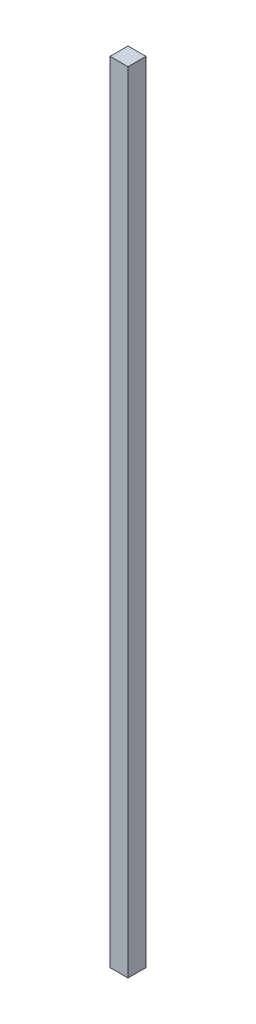
ISO-10303-21;
HEADER;
FILE_DESCRIPTION(('STEP AP214'),'2;1');
FILE_NAME('part.step','',(''),(''),'','','');
FILE_SCHEMA(('AUTOMOTIVE_DESIGN { 1 0 10303 214 1 1 1 1 }'));
ENDSEC;
DATA;
#1=APPLICATION_CONTEXT('core data for automotive mechanical design processes');
#2=APPLICATION_PROTOCOL_DEFINITION('international standard','automotive_design',2000,#1);
#3=PRODUCT_CONTEXT('',#1,'mechanical');
#4=PRODUCT('Part','Part','',(#3));
#5=PRODUCT_RELATED_PRODUCT_CATEGORY('part','',(#4));
#6=PRODUCT_DEFINITION_FORMATION('','',#4);
#7=PRODUCT_DEFINITION_CONTEXT('part definition',#1,'design');
#8=PRODUCT_DEFINITION('design','',#6,#7);
#9=PRODUCT_DEFINITION_SHAPE('','',#8);
#10=(LENGTH_UNIT() NAMED_UNIT(*) SI_UNIT(.MILLI.,.METRE.));
#11=(NAMED_UNIT(*) PLANE_ANGLE_UNIT() SI_UNIT($,.RADIAN.));
#12=(NAMED_UNIT(*) SI_UNIT($,.STERADIAN.) SOLID_ANGLE_UNIT());
#13=UNCERTAINTY_MEASURE_WITH_UNIT(LENGTH_MEASURE(1.E-05),#10,'distance_accuracy_value','');
#14=(GEOMETRIC_REPRESENTATION_CONTEXT(3) GLOBAL_UNCERTAINTY_ASSIGNED_CONTEXT((#13)) GLOBAL_UNIT_ASSIGNED_CONTEXT((#10,
#11,#12)) REPRESENTATION_CONTEXT('',''));
#15=CARTESIAN_POINT('',(0.,0.,0.));
#16=DIRECTION('',(0.,0.,1.));
#17=DIRECTION('',(1.,0.,0.));
#18=AXIS2_PLACEMENT_3D('',#15,#16,#17);
#19=CARTESIAN_POINT('',(-2.5,-110.,5.));
#20=DIRECTION('',(1.,0.,0.));
#21=DIRECTION('',(0.,0.,-1.));
#22=AXIS2_PLACEMENT_3D('',#19,#20,#21);
#23=PLANE('',#22);
#24=DIRECTION('',(0.,-1.,0.));
#25=VECTOR('',#24,1.);
#26=CARTESIAN_POINT('',(-2.5,-110.,0.));
#27=LINE('',#26,#25);
#28=CARTESIAN_POINT('',(-2.5,110.,0.));
#29=VERTEX_POINT('',#28);
#30=CARTESIAN_POINT('',(-2.5,-110.,0.));
#31=VERTEX_POINT('',#30);
#32=EDGE_CURVE('E98',#29,#31,#27,.T.);
#33=ORIENTED_EDGE('',*,*,#32,.T.);
#34=DIRECTION('',(0.,0.,-1.));
#35=VECTOR('',#34,1.);
#36=CARTESIAN_POINT('',(-2.5,-110.,5.));
#37=LINE('',#36,#35);
#38=CARTESIAN_POINT('',(-2.5,-110.,5.));
#39=VERTEX_POINT('',#38);
#40=EDGE_CURVE('E11',#39,#31,#37,.T.);
#41=ORIENTED_EDGE('',*,*,#40,.F.);
#42=DIRECTION('',(0.,-1.,0.));
#43=VECTOR('',#42,1.);
#44=CARTESIAN_POINT('',(-2.5,-110.,5.));
#45=LINE('',#44,#43);
#46=CARTESIAN_POINT('',(-2.5,110.,5.));
#47=VERTEX_POINT('',#46);
#48=EDGE_CURVE('E86',#47,#39,#45,.T.);
#49=ORIENTED_EDGE('',*,*,#48,.F.);
#50=DIRECTION('',(0.,0.,-1.));
#51=VECTOR('',#50,1.);
#52=CARTESIAN_POINT('',(-2.5,110.,5.));
#53=LINE('',#52,#51);
#54=EDGE_CURVE('E94',#47,#29,#53,.T.);
#55=ORIENTED_EDGE('',*,*,#54,.T.);
#56=EDGE_LOOP('',(#33,#41,#49,#55));
#57=FACE_BOUND('',#56,.T.);
#58=ADVANCED_FACE('F35',(#57),#23,.F.);
#59=CARTESIAN_POINT('',(2.5,-110.,5.));
#60=DIRECTION('',(0.,1.,0.));
#61=DIRECTION('',(0.,0.,1.));
#62=AXIS2_PLACEMENT_3D('',#59,#60,#61);
#63=PLANE('',#62);
#64=DIRECTION('',(1.,0.,0.));
#65=VECTOR('',#64,1.);
#66=CARTESIAN_POINT('',(2.5,-110.,0.));
#67=LINE('',#66,#65);
#68=CARTESIAN_POINT('',(2.5,-110.,0.));
#69=VERTEX_POINT('',#68);
#70=EDGE_CURVE('E90',#31,#69,#67,.T.);
#71=ORIENTED_EDGE('',*,*,#70,.T.);
#72=DIRECTION('',(0.,0.,-1.));
#73=VECTOR('',#72,1.);
#74=CARTESIAN_POINT('',(2.5,-110.,5.));
#75=LINE('',#74,#73);
#76=CARTESIAN_POINT('',(2.5,-110.,5.));
#77=VERTEX_POINT('',#76);
#78=EDGE_CURVE('E43',#77,#69,#75,.T.);
#79=ORIENTED_EDGE('',*,*,#78,.F.);
#80=DIRECTION('',(1.,0.,0.));
#81=VECTOR('',#80,1.);
#82=CARTESIAN_POINT('',(2.5,-110.,5.));
#83=LINE('',#82,#81);
#84=EDGE_CURVE('E81',#39,#77,#83,.T.);
#85=ORIENTED_EDGE('',*,*,#84,.F.);
#86=ORIENTED_EDGE('',*,*,#40,.T.);
#87=EDGE_LOOP('',(#71,#79,#85,#86));
#88=FACE_BOUND('',#87,.T.);
#89=ADVANCED_FACE('F89',(#88),#63,.F.);
#90=CARTESIAN_POINT('',(2.5,-110.,5.));
#91=DIRECTION('',(-1.,0.,0.));
#92=DIRECTION('',(0.,0.,1.));
#93=AXIS2_PLACEMENT_3D('',#90,#91,#92);
#94=PLANE('',#93);
#95=DIRECTION('',(0.,1.,0.));
#96=VECTOR('',#95,1.);
#97=CARTESIAN_POINT('',(2.5,-110.,0.));
#98=LINE('',#97,#96);
#99=CARTESIAN_POINT('',(2.5,110.,0.));
#100=VERTEX_POINT('',#99);
#101=EDGE_CURVE('E68',#69,#100,#98,.T.);
#102=ORIENTED_EDGE('',*,*,#101,.T.);
#103=DIRECTION('',(0.,0.,-1.));
#104=VECTOR('',#103,1.);
#105=CARTESIAN_POINT('',(2.5,110.,5.));
#106=LINE('',#105,#104);
#107=CARTESIAN_POINT('',(2.5,110.,5.));
#108=VERTEX_POINT('',#107);
#109=EDGE_CURVE('E91',#108,#100,#106,.T.);
#110=ORIENTED_EDGE('',*,*,#109,.F.);
#111=DIRECTION('',(0.,1.,0.));
#112=VECTOR('',#111,1.);
#113=CARTESIAN_POINT('',(2.5,-110.,5.));
#114=LINE('',#113,#112);
#115=EDGE_CURVE('E84',#77,#108,#114,.T.);
#116=ORIENTED_EDGE('',*,*,#115,.F.);
#117=ORIENTED_EDGE('',*,*,#78,.T.);
#118=EDGE_LOOP('',(#102,#110,#116,#117));
#119=FACE_BOUND('',#118,.T.);
#120=ADVANCED_FACE('F92',(#119),#94,.F.);
#121=CARTESIAN_POINT('',(2.5,110.,5.));
#122=DIRECTION('',(0.,-1.,0.));
#123=DIRECTION('',(0.,0.,-1.));
#124=AXIS2_PLACEMENT_3D('',#121,#122,#123);
#125=PLANE('',#124);
#126=DIRECTION('',(-1.,0.,0.));
#127=VECTOR('',#126,1.);
#128=CARTESIAN_POINT('',(2.5,110.,0.));
#129=LINE('',#128,#127);
#130=EDGE_CURVE('E74',#100,#29,#129,.T.);
#131=ORIENTED_EDGE('',*,*,#130,.T.);
#132=ORIENTED_EDGE('',*,*,#54,.F.);
#133=DIRECTION('',(-1.,0.,0.));
#134=VECTOR('',#133,1.);
#135=CARTESIAN_POINT('',(2.5,110.,5.));
#136=LINE('',#135,#134);
#137=EDGE_CURVE('E51',#108,#47,#136,.T.);
#138=ORIENTED_EDGE('',*,*,#137,.F.);
#139=ORIENTED_EDGE('',*,*,#109,.T.);
#140=EDGE_LOOP('',(#131,#132,#138,#139));
#141=FACE_BOUND('',#140,.T.);
#142=ADVANCED_FACE('F105',(#141),#125,.F.);
#143=CARTESIAN_POINT('',(0.,0.,5.));
#144=DIRECTION('',(0.,0.,1.));
#145=DIRECTION('',(1.,0.,0.));
#146=AXIS2_PLACEMENT_3D('',#143,#144,#145);
#147=PLANE('',#146);
#148=ORIENTED_EDGE('',*,*,#48,.T.);
#149=ORIENTED_EDGE('',*,*,#84,.T.);
#150=ORIENTED_EDGE('',*,*,#115,.T.);
#151=ORIENTED_EDGE('',*,*,#137,.T.);
#152=EDGE_LOOP('',(#148,#149,#150,#151));
#153=FACE_BOUND('',#152,.T.);
#154=ADVANCED_FACE('F82',(#153),#147,.T.);
#155=CARTESIAN_POINT('',(0.,0.,0.));
#156=DIRECTION('',(0.,0.,1.));
#157=DIRECTION('',(1.,0.,0.));
#158=AXIS2_PLACEMENT_3D('',#155,#156,#157);
#159=PLANE('',#158);
#160=ORIENTED_EDGE('',*,*,#32,.F.);
#161=ORIENTED_EDGE('',*,*,#130,.F.);
#162=ORIENTED_EDGE('',*,*,#101,.F.);
#163=ORIENTED_EDGE('',*,*,#70,.F.);
#164=EDGE_LOOP('',(#160,#161,#162,#163));
#165=FACE_BOUND('',#164,.T.);
#166=ADVANCED_FACE('F108',(#165),#159,.F.);
#167=CLOSED_SHELL('',(#58,#89,#120,#142,#154,#166));
#168=MANIFOLD_SOLID_BREP('B2',#167);
#169=ADVANCED_BREP_SHAPE_REPRESENTATION('',(#18,#168),#14);
#170=SHAPE_DEFINITION_REPRESENTATION(#9,#169);
ENDSEC;
END-ISO-10303-21;
